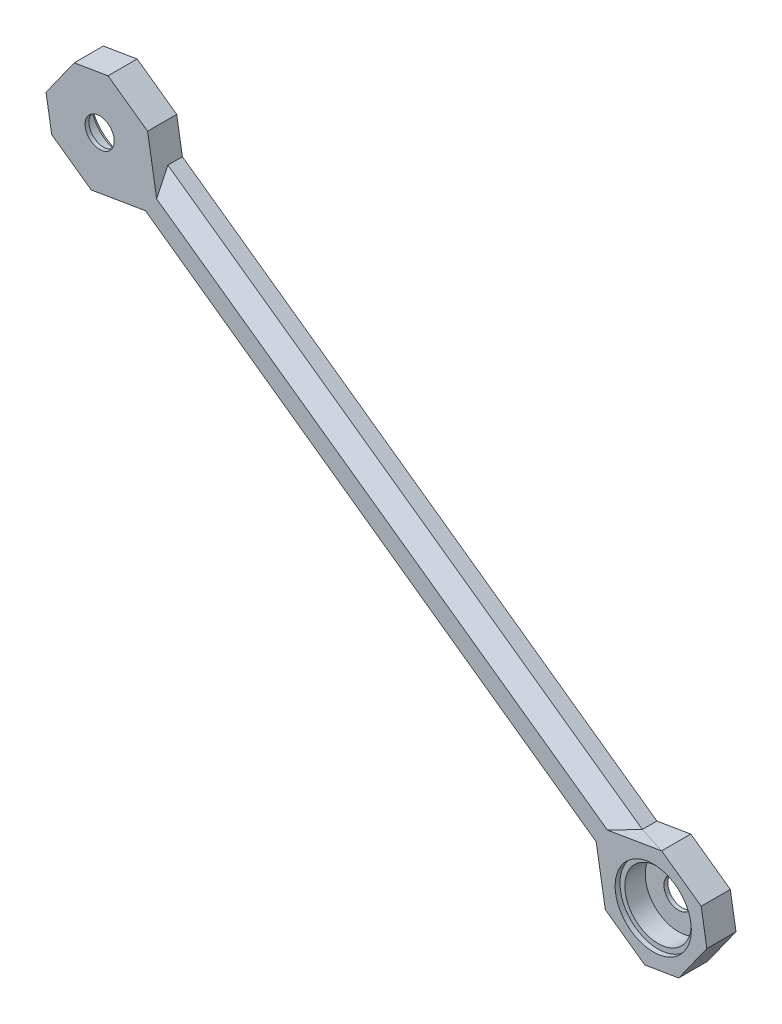
ISO-10303-21;
HEADER;
FILE_DESCRIPTION(('STEP AP214'),'2;1');
FILE_NAME('part.step','',(''),(''),'','','');
FILE_SCHEMA(('AUTOMOTIVE_DESIGN { 1 0 10303 214 1 1 1 1 }'));
ENDSEC;
DATA;
#1=APPLICATION_CONTEXT('core data for automotive mechanical design processes');
#2=APPLICATION_PROTOCOL_DEFINITION('international standard','automotive_design',2000,#1);
#3=PRODUCT_CONTEXT('',#1,'mechanical');
#4=PRODUCT('Part','Part','',(#3));
#5=PRODUCT_RELATED_PRODUCT_CATEGORY('part','',(#4));
#6=PRODUCT_DEFINITION_FORMATION('','',#4);
#7=PRODUCT_DEFINITION_CONTEXT('part definition',#1,'design');
#8=PRODUCT_DEFINITION('design','',#6,#7);
#9=PRODUCT_DEFINITION_SHAPE('','',#8);
#10=(LENGTH_UNIT() NAMED_UNIT(*) SI_UNIT(.MILLI.,.METRE.));
#11=(NAMED_UNIT(*) PLANE_ANGLE_UNIT() SI_UNIT($,.RADIAN.));
#12=(NAMED_UNIT(*) SI_UNIT($,.STERADIAN.) SOLID_ANGLE_UNIT());
#13=UNCERTAINTY_MEASURE_WITH_UNIT(LENGTH_MEASURE(1.E-05),#10,'distance_accuracy_value','');
#14=(GEOMETRIC_REPRESENTATION_CONTEXT(3) GLOBAL_UNCERTAINTY_ASSIGNED_CONTEXT((#13)) GLOBAL_UNIT_ASSIGNED_CONTEXT((#10,
#11,#12)) REPRESENTATION_CONTEXT('',''));
#15=CARTESIAN_POINT('',(0.,0.,0.));
#16=DIRECTION('',(0.,0.,1.));
#17=DIRECTION('',(1.,0.,0.));
#18=AXIS2_PLACEMENT_3D('',#15,#16,#17);
#19=CARTESIAN_POINT('',(24.6033055355398,-560.848772474689,0.800000052154064));
#20=DIRECTION('',(0.,0.,1.));
#21=DIRECTION('',(1.,0.,0.));
#22=AXIS2_PLACEMENT_3D('',#19,#20,#21);
#23=CYLINDRICAL_SURFACE('',#22,6.85);
#24=CARTESIAN_POINT('',(24.6033055355398,-560.848772474689,0.800000052154064));
#25=DIRECTION('',(0.,0.,1.));
#26=DIRECTION('',(1.,0.,0.));
#27=AXIS2_PLACEMENT_3D('',#24,#25,#26);
#28=CIRCLE('',#27,6.85);
#29=CARTESIAN_POINT('',(31.4533055355398,-560.848772474689,0.800000052154064));
#30=VERTEX_POINT('',#29);
#31=EDGE_CURVE('E1136',#30,#30,#28,.T.);
#32=ORIENTED_EDGE('',*,*,#31,.F.);
#33=EDGE_LOOP('',(#32));
#34=FACE_BOUND('',#33,.T.);
#35=CARTESIAN_POINT('',(24.6033055355398,-560.848772474689,5.00000005215406));
#36=DIRECTION('',(0.,0.,1.));
#37=DIRECTION('',(1.,0.,0.));
#38=AXIS2_PLACEMENT_3D('',#35,#36,#37);
#39=CIRCLE('',#38,6.85);
#40=CARTESIAN_POINT('',(31.4533055355398,-560.848772474689,5.00000005215406));
#41=VERTEX_POINT('',#40);
#42=EDGE_CURVE('E1134',#41,#41,#39,.F.);
#43=ORIENTED_EDGE('',*,*,#42,.F.);
#44=EDGE_LOOP('',(#43));
#45=FACE_BOUND('',#44,.T.);
#46=ADVANCED_FACE('F45',(#34,#45),#23,.F.);
#47=CARTESIAN_POINT('',(-89.4171845608694,-479.565260369701,5.2));
#48=DIRECTION('',(0.,0.,-1.));
#49=DIRECTION('',(-1.,0.,0.));
#50=AXIS2_PLACEMENT_3D('',#47,#48,#49);
#51=CYLINDRICAL_SURFACE('',#50,6.84999999999999);
#52=CARTESIAN_POINT('',(-89.4171845608694,-479.565260369701,5.2));
#53=DIRECTION('',(0.,0.,-1.));
#54=DIRECTION('',(-1.,0.,0.));
#55=AXIS2_PLACEMENT_3D('',#52,#53,#54);
#56=CIRCLE('',#55,6.84999999999999);
#57=CARTESIAN_POINT('',(-96.2671845608694,-479.565260369701,5.2));
#58=VERTEX_POINT('',#57);
#59=EDGE_CURVE('E1128',#58,#58,#56,.T.);
#60=ORIENTED_EDGE('',*,*,#59,.F.);
#61=EDGE_LOOP('',(#60));
#62=FACE_BOUND('',#61,.T.);
#63=CARTESIAN_POINT('',(-89.4171845608694,-479.565260369701,1.));
#64=DIRECTION('',(0.,0.,-1.));
#65=DIRECTION('',(-1.,0.,0.));
#66=AXIS2_PLACEMENT_3D('',#63,#64,#65);
#67=CIRCLE('',#66,6.84999999999999);
#68=CARTESIAN_POINT('',(-96.2671845608694,-479.565260369701,1.));
#69=VERTEX_POINT('',#68);
#70=EDGE_CURVE('E1124',#69,#69,#67,.F.);
#71=ORIENTED_EDGE('',*,*,#70,.F.);
#72=EDGE_LOOP('',(#71));
#73=FACE_BOUND('',#72,.T.);
#74=ADVANCED_FACE('F1545',(#62,#73),#51,.F.);
#75=CARTESIAN_POINT('',(289.510451461559,-206.267774443975,0.));
#76=DIRECTION('',(0.814431953554727,-0.580259074060054,0.));
#77=DIRECTION('',(0.580259074060054,0.814431953554727,0.));
#78=AXIS2_PLACEMENT_3D('',#75,#76,#77);
#79=PLANE('',#78);
#80=DIRECTION('',(0.580259074060054,0.814431953554727,0.));
#81=VECTOR('',#80,1.);
#82=CARTESIAN_POINT('',(29.8463255167007,-570.723533630371,0.));
#83=LINE('',#82,#81);
#84=CARTESIAN_POINT('',(29.8463255167007,-570.723533630371,0.));
#85=VERTEX_POINT('',#84);
#86=CARTESIAN_POINT('',(35.6489159166813,-562.579214572906,0.));
#87=VERTEX_POINT('',#86);
#88=EDGE_CURVE('E268',#85,#87,#83,.T.);
#89=ORIENTED_EDGE('',*,*,#88,.T.);
#90=DIRECTION('',(0.,0.,1.));
#91=VECTOR('',#90,1.);
#92=CARTESIAN_POINT('',(35.6489159166813,-562.579214572906,0.));
#93=LINE('',#92,#91);
#94=CARTESIAN_POINT('',(35.6489159166813,-562.579214572906,6.00000005215406));
#95=VERTEX_POINT('',#94);
#96=EDGE_CURVE('E1365',#87,#95,#93,.T.);
#97=ORIENTED_EDGE('',*,*,#96,.T.);
#98=DIRECTION('',(0.580259074060054,0.814431953554727,0.));
#99=VECTOR('',#98,1.);
#100=CARTESIAN_POINT('',(29.8463255167007,-570.723533630371,6.00000005215406));
#101=LINE('',#100,#99);
#102=CARTESIAN_POINT('',(29.8463255167007,-570.723533630371,6.00000005215406));
#103=VERTEX_POINT('',#102);
#104=EDGE_CURVE('E1369',#103,#95,#101,.T.);
#105=ORIENTED_EDGE('',*,*,#104,.F.);
#106=DIRECTION('',(0.,0.,1.));
#107=VECTOR('',#106,1.);
#108=CARTESIAN_POINT('',(29.8463255167007,-570.723533630371,0.));
#109=LINE('',#108,#107);
#110=EDGE_CURVE('E261',#85,#103,#109,.T.);
#111=ORIENTED_EDGE('',*,*,#110,.F.);
#112=EDGE_LOOP('',(#89,#97,#105,#111));
#113=FACE_BOUND('',#112,.T.);
#114=ADVANCED_FACE('F47',(#113),#79,.T.);
#115=CARTESIAN_POINT('',(-57.1976345466679,-9.60368548510984,0.));
#116=DIRECTION('',(0.986195404157694,0.165585702336409,0.));
#117=DIRECTION('',(-0.165585702336409,0.986195404157694,0.));
#118=AXIS2_PLACEMENT_3D('',#115,#116,#117);
#119=PLANE('',#118);
#120=DIRECTION('',(-0.16558570233641,0.986195404157694,0.));
#121=VECTOR('',#120,1.);
#122=CARTESIAN_POINT('',(35.6489159166813,-562.579214572906,6.00000005215406));
#123=LINE('',#122,#121);
#124=CARTESIAN_POINT('',(34.4780497252941,-555.60576915741,6.00000005215406));
#125=VERTEX_POINT('',#124);
#126=EDGE_CURVE('E205',#95,#125,#123,.T.);
#127=ORIENTED_EDGE('',*,*,#126,.F.);
#128=ORIENTED_EDGE('',*,*,#96,.F.);
#129=DIRECTION('',(-0.16558570233641,0.986195404157694,0.));
#130=VECTOR('',#129,1.);
#131=CARTESIAN_POINT('',(35.6489159166813,-562.579214572906,0.));
#132=LINE('',#131,#130);
#133=CARTESIAN_POINT('',(34.4780497252941,-555.60576915741,0.));
#134=VERTEX_POINT('',#133);
#135=EDGE_CURVE('E999',#87,#134,#132,.T.);
#136=ORIENTED_EDGE('',*,*,#135,.T.);
#137=DIRECTION('',(0.,0.,1.));
#138=VECTOR('',#137,1.);
#139=CARTESIAN_POINT('',(34.4780497252941,-555.60576915741,0.));
#140=LINE('',#139,#138);
#141=EDGE_CURVE('E260',#134,#125,#140,.T.);
#142=ORIENTED_EDGE('',*,*,#141,.T.);
#143=EDGE_LOOP('',(#127,#128,#136,#142));
#144=FACE_BOUND('',#143,.T.);
#145=ADVANCED_FACE('F997',(#144),#119,.T.);
#146=CARTESIAN_POINT('',(94.0178684560138,-559.948850045982,0.));
#147=DIRECTION('',(0.165586512036772,-0.986195268205793,0.));
#148=DIRECTION('',(0.986195268205793,0.165586512036772,0.));
#149=AXIS2_PLACEMENT_3D('',#146,#147,#148);
#150=PLANE('',#149);
#151=DIRECTION('',(0.986195268205793,0.165586512036772,0.));
#152=VECTOR('',#151,1.);
#153=CARTESIAN_POINT('',(22.8728707879782,-571.894407272339,0.));
#154=LINE('',#153,#152);
#155=CARTESIAN_POINT('',(22.8728707879782,-571.894407272339,0.));
#156=VERTEX_POINT('',#155);
#157=EDGE_CURVE('E241',#156,#85,#154,.T.);
#158=ORIENTED_EDGE('',*,*,#157,.T.);
#159=ORIENTED_EDGE('',*,*,#110,.T.);
#160=DIRECTION('',(0.986195268205793,0.165586512036772,0.));
#161=VECTOR('',#160,1.);
#162=CARTESIAN_POINT('',(22.8728707879782,-571.894407272339,6.00000005215406));
#163=LINE('',#162,#161);
#164=CARTESIAN_POINT('',(22.8728707879782,-571.894407272339,6.00000005215406));
#165=VERTEX_POINT('',#164);
#166=EDGE_CURVE('E254',#165,#103,#163,.T.);
#167=ORIENTED_EDGE('',*,*,#166,.F.);
#168=DIRECTION('',(0.,0.,1.));
#169=VECTOR('',#168,1.);
#170=CARTESIAN_POINT('',(22.8728707879782,-571.894407272339,0.));
#171=LINE('',#170,#169);
#172=EDGE_CURVE('E1419',#156,#165,#171,.T.);
#173=ORIENTED_EDGE('',*,*,#172,.F.);
#174=EDGE_LOOP('',(#158,#159,#167,#173));
#175=FACE_BOUND('',#174,.T.);
#176=ADVANCED_FACE('F1679',(#175),#150,.T.);
#177=CARTESIAN_POINT('',(-78.1179235721551,-13.1162656978368,0.));
#178=DIRECTION('',(-0.98619542566576,-0.165585574238612,0.));
#179=DIRECTION('',(0.165585574238612,-0.98619542566576,0.));
#180=AXIS2_PLACEMENT_3D('',#177,#178,#179);
#181=PLANE('',#180);
#182=DIRECTION('',(0.,0.,-1.));
#183=VECTOR('',#182,1.);
#184=CARTESIAN_POINT('',(14.7285498678684,-566.091775894165,6.00000005215406));
#185=LINE('',#184,#183);
#186=CARTESIAN_POINT('',(14.7285498678684,-566.091775894165,6.00000005215406));
#187=VERTEX_POINT('',#186);
#188=CARTESIAN_POINT('',(14.7285498678684,-566.091775894165,0.));
#189=VERTEX_POINT('',#188);
#190=EDGE_CURVE('E202',#187,#189,#185,.T.);
#191=ORIENTED_EDGE('',*,*,#190,.F.);
#192=DIRECTION('',(0.165585558226387,-0.986195428354267,0.));
#193=VECTOR('',#192,1.);
#194=CARTESIAN_POINT('',(12.8551656380296,-554.93426322937,6.00000005215406));
#195=LINE('',#194,#193);
#196=CARTESIAN_POINT('',(12.8551656380297,-554.93426322937,6.00000005215405));
#197=VERTEX_POINT('',#196);
#198=EDGE_CURVE('E184',#197,#187,#195,.T.);
#199=ORIENTED_EDGE('',*,*,#198,.F.);
#200=DIRECTION('',(-0.135199959433498,0.80522483621177,0.57735078948323));
#201=VECTOR('',#200,1.);
#202=CARTESIAN_POINT('',(13.5576846078038,-559.118330478668,3.00000002607703));
#203=LINE('',#202,#201);
#204=CARTESIAN_POINT('',(13.5576846078038,-559.118330478668,3.000000026077));
#205=VERTEX_POINT('',#204);
#206=EDGE_CURVE('E194',#205,#197,#203,.T.);
#207=ORIENTED_EDGE('',*,*,#206,.F.);
#208=DIRECTION('',(0.,0.,-1.));
#209=VECTOR('',#208,1.);
#210=CARTESIAN_POINT('',(13.5576846078038,-559.118330478668,3.00000002607703));
#211=LINE('',#210,#209);
#212=CARTESIAN_POINT('',(13.5576846078038,-559.118330478668,0.));
#213=VERTEX_POINT('',#212);
#214=EDGE_CURVE('E233',#205,#213,#211,.T.);
#215=ORIENTED_EDGE('',*,*,#214,.T.);
#216=DIRECTION('',(0.165585574238612,-0.98619542566576,0.));
#217=VECTOR('',#216,1.);
#218=CARTESIAN_POINT('',(13.5576846078038,-559.118330478668,0.));
#219=LINE('',#218,#217);
#220=EDGE_CURVE('E238',#213,#189,#219,.T.);
#221=ORIENTED_EDGE('',*,*,#220,.T.);
#222=EDGE_LOOP('',(#191,#199,#207,#215,#221));
#223=FACE_BOUND('',#222,.T.);
#224=ADVANCED_FACE('F198',(#223),#181,.T.);
#225=CARTESIAN_POINT('',(-262.565958897122,-368.526155219514,0.));
#226=DIRECTION('',(-0.580261704106491,-0.81443007971675,0.));
#227=DIRECTION('',(0.81443007971675,-0.580261704106491,0.));
#228=AXIS2_PLACEMENT_3D('',#225,#226,#227);
#229=PLANE('',#228);
#230=DIRECTION('',(0.81443007971675,-0.580261704106491,0.));
#231=VECTOR('',#230,1.);
#232=CARTESIAN_POINT('',(14.7285498678684,-566.091775894165,0.));
#233=LINE('',#232,#231);
#234=EDGE_CURVE('E581',#189,#156,#233,.T.);
#235=ORIENTED_EDGE('',*,*,#234,.T.);
#236=ORIENTED_EDGE('',*,*,#172,.T.);
#237=DIRECTION('',(-0.81443007971675,0.580261704106491,0.));
#238=VECTOR('',#237,1.);
#239=CARTESIAN_POINT('',(22.8728707879782,-571.894407272339,6.00000005215406));
#240=LINE('',#239,#238);
#241=EDGE_CURVE('E237',#165,#187,#240,.T.);
#242=ORIENTED_EDGE('',*,*,#241,.T.);
#243=ORIENTED_EDGE('',*,*,#190,.T.);
#244=EDGE_LOOP('',(#235,#236,#242,#243));
#245=FACE_BOUND('',#244,.T.);
#246=ADVANCED_FACE('F1661',(#245),#229,.T.);
#247=CARTESIAN_POINT('',(-250.960726123455,-352.23755546168,0.));
#248=DIRECTION('',(0.580261704106491,0.81443007971675,0.));
#249=DIRECTION('',(-0.81443007971675,0.580261704106491,0.));
#250=AXIS2_PLACEMENT_3D('',#247,#248,#249);
#251=PLANE('',#250);
#252=DIRECTION('',(-0.81443007971675,0.580261704106491,0.));
#253=VECTOR('',#252,1.);
#254=CARTESIAN_POINT('',(34.4780497252941,-555.60576915741,6.00000005215406));
#255=LINE('',#254,#253);
#256=CARTESIAN_POINT('',(26.3337288051844,-549.803137779236,6.00000005215406));
#257=VERTEX_POINT('',#256);
#258=EDGE_CURVE('E576',#125,#257,#255,.T.);
#259=ORIENTED_EDGE('',*,*,#258,.F.);
#260=ORIENTED_EDGE('',*,*,#141,.F.);
#261=DIRECTION('',(0.81443007971675,-0.580261704106491,0.));
#262=VECTOR('',#261,1.);
#263=CARTESIAN_POINT('',(26.3337288051844,-549.803137779236,0.));
#264=LINE('',#263,#262);
#265=CARTESIAN_POINT('',(26.3337288051844,-549.803137779236,0.));
#266=VERTEX_POINT('',#265);
#267=EDGE_CURVE('E212',#266,#134,#264,.T.);
#268=ORIENTED_EDGE('',*,*,#267,.F.);
#269=DIRECTION('',(0.,0.,-1.));
#270=VECTOR('',#269,1.);
#271=CARTESIAN_POINT('',(26.3337288051844,-549.803137779236,6.00000005215406));
#272=LINE('',#271,#270);
#273=EDGE_CURVE('E554',#257,#266,#272,.T.);
#274=ORIENTED_EDGE('',*,*,#273,.F.);
#275=EDGE_LOOP('',(#259,#260,#268,#274));
#276=FACE_BOUND('',#275,.T.);
#277=ADVANCED_FACE('F1001',(#276),#251,.T.);
#278=CARTESIAN_POINT('',(90.5041500427496,-539.028809444477,0.00267738503594632));
#279=DIRECTION('',(-0.16558446247261,0.986195612322252,-4.89848655337874E-06));
#280=DIRECTION('',(-0.986195612334084,-0.165584462474596,0.));
#281=AXIS2_PLACEMENT_3D('',#278,#279,#280);
#282=PLANE('',#281);
#283=DIRECTION('',(0.907866353071504,0.152434743551502,0.390566683063259));
#284=VECTOR('',#283,1.);
#285=CARTESIAN_POINT('',(19.3602740764618,-550.974011421204,3.00000002607703));
#286=LINE('',#285,#284);
#287=CARTESIAN_POINT('',(19.3602740764618,-550.974011421204,3.00000002607686));
#288=VERTEX_POINT('',#287);
#289=EDGE_CURVE('E553',#288,#257,#286,.T.);
#290=ORIENTED_EDGE('',*,*,#289,.F.);
#291=DIRECTION('',(-0.805225604579849,-0.135196323217841,0.577350569340149));
#292=VECTOR('',#291,1.);
#293=CARTESIAN_POINT('',(19.3602740764618,-550.974011421204,3.00000002607703));
#294=LINE('',#293,#292);
#295=CARTESIAN_POINT('',(15.1762012392282,-551.676511764527,6.00000005215392));
#296=VERTEX_POINT('',#295);
#297=EDGE_CURVE('E159',#288,#296,#294,.T.);
#298=ORIENTED_EDGE('',*,*,#297,.T.);
#299=DIRECTION('',(-0.986195612334084,-0.165584462474596,0.));
#300=VECTOR('',#299,1.);
#301=CARTESIAN_POINT('',(26.3337288051844,-549.803137779236,6.00000005215406));
#302=LINE('',#301,#300);
#303=EDGE_CURVE('E218',#257,#296,#302,.T.);
#304=ORIENTED_EDGE('',*,*,#303,.F.);
#305=EDGE_LOOP('',(#290,#298,#304));
#306=FACE_BOUND('',#305,.T.);
#307=ADVANCED_FACE('F1004',(#306),#282,.T.);
#308=CARTESIAN_POINT('',(77.6247110762013,-462.320850205347,-0.00234456824753168));
#309=DIRECTION('',(0.165584462472525,-0.98619561232175,-5.00129491775601E-06));
#310=DIRECTION('',(0.986195612334084,0.165584462474596,0.));
#311=AXIS2_PLACEMENT_3D('',#308,#309,#310);
#312=PLANE('',#311);
#313=DIRECTION('',(-0.907866310445912,-0.152434777110581,0.390566769047974));
#314=VECTOR('',#313,1.);
#315=CARTESIAN_POINT('',(-84.1741636395454,-489.487260580063,3.00000002607703));
#316=LINE('',#315,#314);
#317=CARTESIAN_POINT('',(-84.1741667524352,-489.487264949212,3.00000539072692));
#318=VERTEX_POINT('',#317);
#319=CARTESIAN_POINT('',(-91.1476165056229,-490.658134222031,6.00000005215406));
#320=VERTEX_POINT('',#319);
#321=EDGE_CURVE('E1209',#318,#320,#316,.T.);
#322=ORIENTED_EDGE('',*,*,#321,.F.);
#323=DIRECTION('',(-0.805225730620787,-0.135196284193927,-0.577350402690061));
#324=VECTOR('',#323,1.);
#325=CARTESIAN_POINT('',(-79.9900889396667,-488.78476023674,6.00000005215406));
#326=LINE('',#325,#324);
#327=CARTESIAN_POINT('',(-79.9900889396667,-488.78476023674,6.00000005215401));
#328=VERTEX_POINT('',#327);
#329=EDGE_CURVE('E1213',#328,#318,#326,.T.);
#330=ORIENTED_EDGE('',*,*,#329,.F.);
#331=DIRECTION('',(-0.986195612334084,-0.165584462474596,0.));
#332=VECTOR('',#331,1.);
#333=CARTESIAN_POINT('',(-79.9900889396667,-488.78476023674,6.00000005215406));
#334=LINE('',#333,#332);
#335=EDGE_CURVE('E188',#328,#320,#334,.T.);
#336=ORIENTED_EDGE('',*,*,#335,.T.);
#337=EDGE_LOOP('',(#322,#330,#336));
#338=FACE_BOUND('',#337,.T.);
#339=ADVANCED_FACE('F1636',(#338),#312,.T.);
#340=CARTESIAN_POINT('',(-259.664083093238,-364.45584996912,0.));
#341=DIRECTION('',(0.580258914671925,0.814432067114109,0.));
#342=DIRECTION('',(-0.814432067114109,0.580258914671925,0.));
#343=AXIS2_PLACEMENT_3D('',#340,#341,#342);
#344=PLANE('',#343);
#345=DIRECTION('',(0.,0.,1.));
#346=VECTOR('',#345,1.);
#347=CARTESIAN_POINT('',(-84.1741636395454,-489.487260580063,0.));
#348=LINE('',#347,#346);
#349=CARTESIAN_POINT('',(-84.1741636395454,-489.487260580063,0.));
#350=VERTEX_POINT('',#349);
#351=EDGE_CURVE('E559',#350,#318,#348,.T.);
#352=ORIENTED_EDGE('',*,*,#351,.F.);
#353=DIRECTION('',(0.814432067114109,-0.580258914671925,0.));
#354=VECTOR('',#353,1.);
#355=CARTESIAN_POINT('',(-84.1741636395454,-489.487260580063,0.));
#356=LINE('',#355,#354);
#357=EDGE_CURVE('E204',#350,#213,#356,.T.);
#358=ORIENTED_EDGE('',*,*,#357,.T.);
#359=ORIENTED_EDGE('',*,*,#214,.F.);
#360=DIRECTION('',(-0.814432067114109,0.580258914671925,0.));
#361=VECTOR('',#360,1.);
#362=CARTESIAN_POINT('',(13.5576846078038,-559.118330478668,3.00000002607703));
#363=LINE('',#362,#361);
#364=EDGE_CURVE('E210',#205,#318,#363,.T.);
#365=ORIENTED_EDGE('',*,*,#364,.T.);
#366=EDGE_LOOP('',(#352,#358,#359,#365));
#367=FACE_BOUND('',#366,.T.);
#368=ADVANCED_FACE('F1628',(#367),#344,.F.);
#369=CARTESIAN_POINT('',(77.6256369026728,-462.320356985992,0.));
#370=DIRECTION('',(-0.16558655505307,0.986195260983167,0.));
#371=DIRECTION('',(-0.986195260983167,-0.16558655505307,0.));
#372=AXIS2_PLACEMENT_3D('',#369,#370,#371);
#373=PLANE('',#372);
#374=ORIENTED_EDGE('',*,*,#351,.T.);
#375=ORIENTED_EDGE('',*,*,#321,.T.);
#376=DIRECTION('',(0.,0.,1.));
#377=VECTOR('',#376,1.);
#378=CARTESIAN_POINT('',(-91.1476165056229,-490.658134222031,0.));
#379=LINE('',#378,#377);
#380=CARTESIAN_POINT('',(-91.1476165056229,-490.658134222031,0.));
#381=VERTEX_POINT('',#380);
#382=EDGE_CURVE('E545',#381,#320,#379,.T.);
#383=ORIENTED_EDGE('',*,*,#382,.F.);
#384=DIRECTION('',(0.986195260983167,0.16558655505307,0.));
#385=VECTOR('',#384,1.);
#386=CARTESIAN_POINT('',(-91.1476165056229,-490.658134222031,0.));
#387=LINE('',#386,#385);
#388=EDGE_CURVE('E564',#381,#350,#387,.T.);
#389=ORIENTED_EDGE('',*,*,#388,.T.);
#390=EDGE_LOOP('',(#374,#375,#383,#389));
#391=FACE_BOUND('',#390,.T.);
#392=ADVANCED_FACE('F1618',(#391),#373,.F.);
#393=CARTESIAN_POINT('',(90.5052430231328,-539.02845901729,0.));
#394=DIRECTION('',(0.165586512036772,-0.986195268205793,0.));
#395=DIRECTION('',(0.986195268205793,0.165586512036772,0.));
#396=AXIS2_PLACEMENT_3D('',#393,#394,#395);
#397=PLANE('',#396);
#398=DIRECTION('',(0.,0.,1.));
#399=VECTOR('',#398,1.);
#400=CARTESIAN_POINT('',(19.3602740764618,-550.974011421204,0.));
#401=LINE('',#400,#399);
#402=CARTESIAN_POINT('',(19.3602740764618,-550.974011421204,0.));
#403=VERTEX_POINT('',#402);
#404=EDGE_CURVE('E541',#403,#288,#401,.T.);
#405=ORIENTED_EDGE('',*,*,#404,.T.);
#406=ORIENTED_EDGE('',*,*,#289,.T.);
#407=ORIENTED_EDGE('',*,*,#273,.T.);
#408=DIRECTION('',(-0.986195268205793,-0.165586512036772,0.));
#409=VECTOR('',#408,1.);
#410=CARTESIAN_POINT('',(26.3337288051844,-549.803137779236,0.));
#411=LINE('',#410,#409);
#412=EDGE_CURVE('E546',#266,#403,#411,.T.);
#413=ORIENTED_EDGE('',*,*,#412,.T.);
#414=EDGE_LOOP('',(#405,#406,#407,#413));
#415=FACE_BOUND('',#414,.T.);
#416=ADVANCED_FACE('F1006',(#415),#397,.F.);
#417=CARTESIAN_POINT('',(-253.861465544377,-356.31162495909,0.));
#418=DIRECTION('',(-0.580258768278229,-0.814432171415295,0.));
#419=DIRECTION('',(0.814432171415295,-0.580258768278229,0.));
#420=AXIS2_PLACEMENT_3D('',#417,#418,#419);
#421=PLANE('',#420);
#422=DIRECTION('',(0.,0.,-1.));
#423=VECTOR('',#422,1.);
#424=CARTESIAN_POINT('',(-78.3715695142746,-481.342971324921,3.00000002607703));
#425=LINE('',#424,#423);
#426=CARTESIAN_POINT('',(-78.3715665341136,-481.342967142065,3.00000516196629));
#427=VERTEX_POINT('',#426);
#428=CARTESIAN_POINT('',(-78.3715695142746,-481.342971324921,0.));
#429=VERTEX_POINT('',#428);
#430=EDGE_CURVE('E1235',#427,#429,#425,.T.);
#431=ORIENTED_EDGE('',*,*,#430,.F.);
#432=DIRECTION('',(0.814432171415295,-0.580258768278229,0.));
#433=VECTOR('',#432,1.);
#434=CARTESIAN_POINT('',(-78.3715695142746,-481.342971324921,3.00000002607703));
#435=LINE('',#434,#433);
#436=EDGE_CURVE('E549',#427,#288,#435,.T.);
#437=ORIENTED_EDGE('',*,*,#436,.T.);
#438=ORIENTED_EDGE('',*,*,#404,.F.);
#439=DIRECTION('',(-0.814432171415295,0.580258768278229,0.));
#440=VECTOR('',#439,1.);
#441=CARTESIAN_POINT('',(19.3602740764618,-550.974011421204,0.));
#442=LINE('',#441,#440);
#443=EDGE_CURVE('E1014',#403,#429,#442,.T.);
#444=ORIENTED_EDGE('',*,*,#443,.T.);
#445=EDGE_LOOP('',(#431,#437,#438,#444));
#446=FACE_BOUND('',#445,.T.);
#447=ADVANCED_FACE('F1013',(#446),#421,.F.);
#448=CARTESIAN_POINT('',(74.113015372945,-441.39999479152,0.));
#449=DIRECTION('',(-0.16558655505307,0.986195260983167,0.));
#450=DIRECTION('',(-0.986195260983167,-0.16558655505307,0.));
#451=AXIS2_PLACEMENT_3D('',#448,#449,#450);
#452=PLANE('',#451);
#453=DIRECTION('',(-0.986195260983167,-0.16558655505307,0.));
#454=VECTOR('',#453,1.);
#455=CARTESIAN_POINT('',(-87.686762213707,-468.56689453125,0.));
#456=LINE('',#455,#454);
#457=CARTESIAN_POINT('',(-87.686762213707,-468.56689453125,0.));
#458=VERTEX_POINT('',#457);
#459=CARTESIAN_POINT('',(-94.6602150797844,-469.737768173218,0.));
#460=VERTEX_POINT('',#459);
#461=EDGE_CURVE('E527',#458,#460,#456,.T.);
#462=ORIENTED_EDGE('',*,*,#461,.T.);
#463=DIRECTION('',(0.,0.,1.));
#464=VECTOR('',#463,1.);
#465=CARTESIAN_POINT('',(-94.6602150797844,-469.737768173218,0.));
#466=LINE('',#465,#464);
#467=CARTESIAN_POINT('',(-94.6602150797844,-469.737768173218,6.00000005215406));
#468=VERTEX_POINT('',#467);
#469=EDGE_CURVE('E1021',#460,#468,#466,.T.);
#470=ORIENTED_EDGE('',*,*,#469,.T.);
#471=DIRECTION('',(0.986195260983167,0.16558655505307,0.));
#472=VECTOR('',#471,1.);
#473=CARTESIAN_POINT('',(-94.6602150797844,-469.737768173218,6.00000005215406));
#474=LINE('',#473,#472);
#475=CARTESIAN_POINT('',(-87.686762213707,-468.56689453125,6.00000005215406));
#476=VERTEX_POINT('',#475);
#477=EDGE_CURVE('E1030',#468,#476,#474,.T.);
#478=ORIENTED_EDGE('',*,*,#477,.T.);
#479=DIRECTION('',(0.,0.,1.));
#480=VECTOR('',#479,1.);
#481=CARTESIAN_POINT('',(-87.686762213707,-468.56689453125,0.));
#482=LINE('',#481,#480);
#483=EDGE_CURVE('E1113',#458,#476,#482,.T.);
#484=ORIENTED_EDGE('',*,*,#483,.F.);
#485=EDGE_LOOP('',(#462,#470,#478,#484));
#486=FACE_BOUND('',#485,.T.);
#487=ADVANCED_FACE('F1594',(#486),#452,.T.);
#488=CARTESIAN_POINT('',(-154.825668387373,-25.9956671546598,0.));
#489=DIRECTION('',(0.986195519717988,0.165585014080885,0.));
#490=DIRECTION('',(-0.165585014080885,0.986195519717988,0.));
#491=AXIS2_PLACEMENT_3D('',#488,#489,#490);
#492=PLANE('',#491);
#493=DIRECTION('',(0.,0.,-1.));
#494=VECTOR('',#493,1.);
#495=CARTESIAN_POINT('',(-79.5424357056618,-474.369496107101,6.00000005215406));
#496=LINE('',#495,#494);
#497=CARTESIAN_POINT('',(-79.5424357056618,-474.369496107101,6.00000005215406));
#498=VERTEX_POINT('',#497);
#499=CARTESIAN_POINT('',(-79.5424357056618,-474.369496107101,0.));
#500=VERTEX_POINT('',#499);
#501=EDGE_CURVE('E151',#498,#500,#496,.T.);
#502=ORIENTED_EDGE('',*,*,#501,.F.);
#503=DIRECTION('',(0.165585318042993,-0.986195468681843,0.));
#504=VECTOR('',#503,1.);
#505=CARTESIAN_POINT('',(-79.5424357056618,-474.369496107101,6.00000005215406));
#506=LINE('',#505,#504);
#507=CARTESIAN_POINT('',(-77.6690481823151,-485.527012877944,5.99999986393853));
#508=VERTEX_POINT('',#507);
#509=EDGE_CURVE('E526',#498,#508,#506,.T.);
#510=ORIENTED_EDGE('',*,*,#509,.T.);
#511=DIRECTION('',(-0.135199880003315,0.805222897584278,-0.57735351185653));
#512=VECTOR('',#511,1.);
#513=CARTESIAN_POINT('',(-77.6690542697906,-485.527008771896,6.00000005215406));
#514=LINE('',#513,#512);
#515=EDGE_CURVE('E521',#508,#427,#514,.T.);
#516=ORIENTED_EDGE('',*,*,#515,.T.);
#517=ORIENTED_EDGE('',*,*,#430,.T.);
#518=DIRECTION('',(-0.165585014080885,0.986195519717988,0.));
#519=VECTOR('',#518,1.);
#520=CARTESIAN_POINT('',(-78.3715695142746,-481.342971324921,0.));
#521=LINE('',#520,#519);
#522=EDGE_CURVE('E1019',#429,#500,#521,.T.);
#523=ORIENTED_EDGE('',*,*,#522,.T.);
#524=EDGE_LOOP('',(#502,#510,#516,#517,#523));
#525=FACE_BOUND('',#524,.T.);
#526=ADVANCED_FACE('F1230',(#525),#492,.T.);
#527=CARTESIAN_POINT('',(-250.960358086278,-352.239089676026,0.));
#528=DIRECTION('',(0.580259463253697,0.814431676265438,0.));
#529=DIRECTION('',(-0.814431676265438,0.580259463253697,0.));
#530=AXIS2_PLACEMENT_3D('',#527,#528,#529);
#531=PLANE('',#530);
#532=DIRECTION('',(-0.814431676265438,0.580259463253697,0.));
#533=VECTOR('',#532,1.);
#534=CARTESIAN_POINT('',(-79.5424357056618,-474.369496107101,0.));
#535=LINE('',#534,#533);
#536=EDGE_CURVE('E1107',#500,#458,#535,.T.);
#537=ORIENTED_EDGE('',*,*,#536,.T.);
#538=ORIENTED_EDGE('',*,*,#483,.T.);
#539=DIRECTION('',(0.814431676265438,-0.580259463253697,0.));
#540=VECTOR('',#539,1.);
#541=CARTESIAN_POINT('',(-87.686762213707,-468.56689453125,6.00000005215406));
#542=LINE('',#541,#540);
#543=EDGE_CURVE('E1239',#476,#498,#542,.T.);
#544=ORIENTED_EDGE('',*,*,#543,.T.);
#545=ORIENTED_EDGE('',*,*,#501,.T.);
#546=EDGE_LOOP('',(#537,#538,#544,#545));
#547=FACE_BOUND('',#546,.T.);
#548=ADVANCED_FACE('F1577',(#547),#531,.T.);
#549=CARTESIAN_POINT('',(-262.565653194173,-368.527534622462,0.));
#550=DIRECTION('',(-0.58025981535423,-0.814431425403683,0.));
#551=DIRECTION('',(0.814431425403683,-0.58025981535423,0.));
#552=AXIS2_PLACEMENT_3D('',#549,#550,#551);
#553=PLANE('',#552);
#554=DIRECTION('',(0.814431425403683,-0.58025981535423,0.));
#555=VECTOR('',#554,1.);
#556=CARTESIAN_POINT('',(-99.2919355630875,-484.855532646179,0.));
#557=LINE('',#556,#555);
#558=CARTESIAN_POINT('',(-99.2919355630875,-484.855532646179,0.));
#559=VERTEX_POINT('',#558);
#560=EDGE_CURVE('E1100',#559,#381,#557,.T.);
#561=ORIENTED_EDGE('',*,*,#560,.T.);
#562=ORIENTED_EDGE('',*,*,#382,.T.);
#563=DIRECTION('',(0.814431425403683,-0.58025981535423,0.));
#564=VECTOR('',#563,1.);
#565=CARTESIAN_POINT('',(-99.2919355630875,-484.855532646179,6.00000005215406));
#566=LINE('',#565,#564);
#567=CARTESIAN_POINT('',(-99.2919355630875,-484.855532646179,6.00000005215406));
#568=VERTEX_POINT('',#567);
#569=EDGE_CURVE('E1051',#568,#320,#566,.T.);
#570=ORIENTED_EDGE('',*,*,#569,.F.);
#571=DIRECTION('',(0.,0.,1.));
#572=VECTOR('',#571,1.);
#573=CARTESIAN_POINT('',(-99.2919355630875,-484.855532646179,0.));
#574=LINE('',#573,#572);
#575=EDGE_CURVE('E1106',#559,#568,#574,.T.);
#576=ORIENTED_EDGE('',*,*,#575,.F.);
#577=EDGE_LOOP('',(#561,#562,#570,#576));
#578=FACE_BOUND('',#577,.T.);
#579=ADVANCED_FACE('F1190',(#578),#553,.T.);
#580=CARTESIAN_POINT('',(-175.746327175569,-29.5084309820589,0.));
#581=DIRECTION('',(-0.986195404157694,-0.165585702336409,0.));
#582=DIRECTION('',(0.165585702336409,-0.986195404157694,0.));
#583=AXIS2_PLACEMENT_3D('',#580,#581,#582);
#584=PLANE('',#583);
#585=DIRECTION('',(0.16558570233641,-0.986195404157694,0.));
#586=VECTOR('',#585,1.);
#587=CARTESIAN_POINT('',(-100.462801754475,-477.882087230682,0.));
#588=LINE('',#587,#586);
#589=CARTESIAN_POINT('',(-100.462801754475,-477.882087230682,0.));
#590=VERTEX_POINT('',#589);
#591=EDGE_CURVE('E1168',#590,#559,#588,.T.);
#592=ORIENTED_EDGE('',*,*,#591,.T.);
#593=ORIENTED_EDGE('',*,*,#575,.T.);
#594=DIRECTION('',(0.16558570233641,-0.986195404157694,0.));
#595=VECTOR('',#594,1.);
#596=CARTESIAN_POINT('',(-100.462801754475,-477.882087230682,6.00000005215406));
#597=LINE('',#596,#595);
#598=CARTESIAN_POINT('',(-100.462801754475,-477.882087230682,6.00000005215406));
#599=VERTEX_POINT('',#598);
#600=EDGE_CURVE('E12',#599,#568,#597,.T.);
#601=ORIENTED_EDGE('',*,*,#600,.F.);
#602=DIRECTION('',(0.,0.,1.));
#603=VECTOR('',#602,1.);
#604=CARTESIAN_POINT('',(-100.462801754475,-477.882087230682,0.));
#605=LINE('',#604,#603);
#606=EDGE_CURVE('E1164',#590,#599,#605,.T.);
#607=ORIENTED_EDGE('',*,*,#606,.F.);
#608=EDGE_LOOP('',(#592,#593,#601,#607));
#609=FACE_BOUND('',#608,.T.);
#610=ADVANCED_FACE('F1178',(#609),#584,.T.);
#611=CARTESIAN_POINT('',(159.201255553948,-113.426190397663,0.));
#612=DIRECTION('',(-0.814432129605077,0.580258826961675,0.));
#613=DIRECTION('',(-0.580258826961675,-0.814432129605077,0.));
#614=AXIS2_PLACEMENT_3D('',#611,#612,#613);
#615=PLANE('',#614);
#616=DIRECTION('',(-0.580258826961675,-0.814432129605077,0.));
#617=VECTOR('',#616,1.);
#618=CARTESIAN_POINT('',(-94.6602150797844,-469.737768173218,6.00000005215406));
#619=LINE('',#618,#617);
#620=EDGE_CURVE('E56',#468,#599,#619,.T.);
#621=ORIENTED_EDGE('',*,*,#620,.F.);
#622=ORIENTED_EDGE('',*,*,#469,.F.);
#623=DIRECTION('',(-0.580258826961675,-0.814432129605077,0.));
#624=VECTOR('',#623,1.);
#625=CARTESIAN_POINT('',(-94.6602150797844,-469.737768173218,0.));
#626=LINE('',#625,#624);
#627=EDGE_CURVE('E1046',#460,#590,#626,.T.);
#628=ORIENTED_EDGE('',*,*,#627,.T.);
#629=ORIENTED_EDGE('',*,*,#606,.T.);
#630=EDGE_LOOP('',(#621,#622,#628,#629));
#631=FACE_BOUND('',#630,.T.);
#632=ADVANCED_FACE('F1185',(#631),#615,.T.);
#633=CARTESIAN_POINT('',(0.,0.,0.));
#634=DIRECTION('',(0.,0.,1.));
#635=DIRECTION('',(1.,0.,0.));
#636=AXIS2_PLACEMENT_3D('',#633,#634,#635);
#637=PLANE('',#636);
#638=CARTESIAN_POINT('',(24.6033055355398,-560.848772474689,0.));
#639=DIRECTION('',(0.,0.,-1.));
#640=DIRECTION('',(-1.,0.,0.));
#641=AXIS2_PLACEMENT_3D('',#638,#639,#640);
#642=CIRCLE('',#641,3.00000000000001);
#643=CARTESIAN_POINT('',(21.6033055355397,-560.848772474689,0.));
#644=VERTEX_POINT('',#643);
#645=EDGE_CURVE('E1150',#644,#644,#642,.T.);
#646=ORIENTED_EDGE('',*,*,#645,.F.);
#647=EDGE_LOOP('',(#646));
#648=FACE_BOUND('',#647,.T.);
#649=CARTESIAN_POINT('',(-89.4171845608694,-479.565260369701,0.));
#650=DIRECTION('',(0.,0.,-1.));
#651=DIRECTION('',(-1.,0.,0.));
#652=AXIS2_PLACEMENT_3D('',#649,#650,#651);
#653=CIRCLE('',#652,7.84999999999999);
#654=CARTESIAN_POINT('',(-97.2671845608694,-479.565260369701,0.));
#655=VERTEX_POINT('',#654);
#656=EDGE_CURVE('E1132',#655,#655,#653,.T.);
#657=ORIENTED_EDGE('',*,*,#656,.F.);
#658=EDGE_LOOP('',(#657));
#659=FACE_BOUND('',#658,.T.);
#660=ORIENTED_EDGE('',*,*,#522,.F.);
#661=ORIENTED_EDGE('',*,*,#443,.F.);
#662=ORIENTED_EDGE('',*,*,#412,.F.);
#663=ORIENTED_EDGE('',*,*,#267,.T.);
#664=ORIENTED_EDGE('',*,*,#135,.F.);
#665=ORIENTED_EDGE('',*,*,#88,.F.);
#666=ORIENTED_EDGE('',*,*,#157,.F.);
#667=ORIENTED_EDGE('',*,*,#234,.F.);
#668=ORIENTED_EDGE('',*,*,#220,.F.);
#669=ORIENTED_EDGE('',*,*,#357,.F.);
#670=ORIENTED_EDGE('',*,*,#388,.F.);
#671=ORIENTED_EDGE('',*,*,#560,.F.);
#672=ORIENTED_EDGE('',*,*,#591,.F.);
#673=ORIENTED_EDGE('',*,*,#627,.F.);
#674=ORIENTED_EDGE('',*,*,#461,.F.);
#675=ORIENTED_EDGE('',*,*,#536,.F.);
#676=EDGE_LOOP('',(#660,#661,#662,#663,#664,#665,#666,#667,#668,#669,#670,#671,#672,#673,#674,#675));
#677=FACE_BOUND('',#676,.T.);
#678=ADVANCED_FACE('F1017',(#648,#659,#677),#637,.F.);
#679=CARTESIAN_POINT('',(0.,0.,6.00000005215406));
#680=DIRECTION('',(0.,0.,-1.));
#681=DIRECTION('',(-1.,0.,0.));
#682=AXIS2_PLACEMENT_3D('',#679,#680,#681);
#683=PLANE('',#682);
#684=CARTESIAN_POINT('',(24.6033055355398,-560.848772474689,6.00000005215406));
#685=DIRECTION('',(0.,0.,1.));
#686=DIRECTION('',(1.,0.,0.));
#687=AXIS2_PLACEMENT_3D('',#684,#685,#686);
#688=CIRCLE('',#687,7.85);
#689=CARTESIAN_POINT('',(32.4533055355398,-560.848772474689,6.00000005215406));
#690=VERTEX_POINT('',#689);
#691=EDGE_CURVE('E1143',#690,#690,#688,.T.);
#692=ORIENTED_EDGE('',*,*,#691,.F.);
#693=EDGE_LOOP('',(#692));
#694=FACE_BOUND('',#693,.T.);
#695=CARTESIAN_POINT('',(-89.4171845608694,-479.565260369701,6.00000005215406));
#696=DIRECTION('',(0.,0.,1.));
#697=DIRECTION('',(1.,0.,0.));
#698=AXIS2_PLACEMENT_3D('',#695,#696,#697);
#699=CIRCLE('',#698,3.00000000000001);
#700=CARTESIAN_POINT('',(-86.4171845608694,-479.565260369701,6.00000005215406));
#701=VERTEX_POINT('',#700);
#702=EDGE_CURVE('E1133',#701,#701,#699,.T.);
#703=ORIENTED_EDGE('',*,*,#702,.F.);
#704=EDGE_LOOP('',(#703));
#705=FACE_BOUND('',#704,.T.);
#706=ORIENTED_EDGE('',*,*,#198,.T.);
#707=ORIENTED_EDGE('',*,*,#241,.F.);
#708=ORIENTED_EDGE('',*,*,#166,.T.);
#709=ORIENTED_EDGE('',*,*,#104,.T.);
#710=ORIENTED_EDGE('',*,*,#126,.T.);
#711=ORIENTED_EDGE('',*,*,#258,.T.);
#712=ORIENTED_EDGE('',*,*,#303,.T.);
#713=DIRECTION('',(-0.81443212174621,0.580258837992121,0.));
#714=VECTOR('',#713,1.);
#715=CARTESIAN_POINT('',(15.1762012392282,-551.676511764526,6.00000005215406));
#716=LINE('',#715,#714);
#717=EDGE_CURVE('E164',#296,#508,#716,.T.);
#718=ORIENTED_EDGE('',*,*,#717,.T.);
#719=ORIENTED_EDGE('',*,*,#509,.F.);
#720=ORIENTED_EDGE('',*,*,#543,.F.);
#721=ORIENTED_EDGE('',*,*,#477,.F.);
#722=ORIENTED_EDGE('',*,*,#620,.T.);
#723=ORIENTED_EDGE('',*,*,#600,.T.);
#724=ORIENTED_EDGE('',*,*,#569,.T.);
#725=ORIENTED_EDGE('',*,*,#335,.F.);
#726=DIRECTION('',(0.814432118995538,-0.580258841852874,0.));
#727=VECTOR('',#726,1.);
#728=CARTESIAN_POINT('',(-79.9900889396667,-488.78476023674,6.00000005215406));
#729=LINE('',#728,#727);
#730=EDGE_CURVE('E180',#328,#197,#729,.T.);
#731=ORIENTED_EDGE('',*,*,#730,.T.);
#732=EDGE_LOOP('',(#706,#707,#708,#709,#710,#711,#712,#718,#719,#720,#721,#722,#723,#724,#725,#731));
#733=FACE_BOUND('',#732,.T.);
#734=ADVANCED_FACE('F182',(#694,#705,#733),#683,.F.);
#735=CARTESIAN_POINT('',(-126.061025782532,-176.935088232061,-217.248489458046));
#736=DIRECTION('',(0.410306049118392,0.575892005893627,0.707104902828902));
#737=DIRECTION('',(0.,-0.775378630721746,0.6314966183758));
#738=AXIS2_PLACEMENT_3D('',#735,#736,#737);
#739=PLANE('',#738);
#740=ORIENTED_EDGE('',*,*,#436,.F.);
#741=ORIENTED_EDGE('',*,*,#515,.F.);
#742=ORIENTED_EDGE('',*,*,#717,.F.);
#743=ORIENTED_EDGE('',*,*,#297,.F.);
#744=EDGE_LOOP('',(#740,#741,#742,#743));
#745=FACE_BOUND('',#744,.T.);
#746=ADVANCED_FACE('F1542',(#745),#739,.T.);
#747=CARTESIAN_POINT('',(-130.702600269057,-183.449846891505,225.248478101957));
#748=DIRECTION('',(0.410305243249623,0.575890869026152,-0.707106296347425));
#749=DIRECTION('',(0.,0.775379850509296,0.631495120665379));
#750=AXIS2_PLACEMENT_3D('',#747,#748,#749);
#751=PLANE('',#750);
#752=ORIENTED_EDGE('',*,*,#329,.T.);
#753=ORIENTED_EDGE('',*,*,#364,.F.);
#754=ORIENTED_EDGE('',*,*,#206,.T.);
#755=ORIENTED_EDGE('',*,*,#730,.F.);
#756=EDGE_LOOP('',(#752,#753,#754,#755));
#757=FACE_BOUND('',#756,.T.);
#758=ADVANCED_FACE('F208',(#757),#751,.F.);
#759=CARTESIAN_POINT('',(-89.4171845608694,-479.565260369701,5.2));
#760=DIRECTION('',(0.,0.,-1.));
#761=DIRECTION('',(-1.,0.,0.));
#762=AXIS2_PLACEMENT_3D('',#759,#760,#761);
#763=PLANE('',#762);
#764=CARTESIAN_POINT('',(-89.4171845608694,-479.565260369701,5.2));
#765=DIRECTION('',(0.,0.,-1.));
#766=DIRECTION('',(-1.,0.,0.));
#767=AXIS2_PLACEMENT_3D('',#764,#765,#766);
#768=CIRCLE('',#767,3.00000000000001);
#769=CARTESIAN_POINT('',(-92.4171845608694,-479.565260369701,5.2));
#770=VERTEX_POINT('',#769);
#771=EDGE_CURVE('E1130',#770,#770,#768,.T.);
#772=ORIENTED_EDGE('',*,*,#771,.F.);
#773=EDGE_LOOP('',(#772));
#774=FACE_BOUND('',#773,.T.);
#775=ORIENTED_EDGE('',*,*,#59,.T.);
#776=EDGE_LOOP('',(#775));
#777=FACE_BOUND('',#776,.T.);
#778=ADVANCED_FACE('F2253',(#774,#777),#763,.T.);
#779=CARTESIAN_POINT('',(-89.4171845608694,-479.565260369701,1.));
#780=DIRECTION('',(0.,0.,-1.));
#781=DIRECTION('',(-1.,0.,0.));
#782=AXIS2_PLACEMENT_3D('',#779,#780,#781);
#783=PLANE('',#782);
#784=CARTESIAN_POINT('',(-89.4171845608694,-479.565260369701,1.));
#785=DIRECTION('',(0.,0.,-1.));
#786=DIRECTION('',(-1.,0.,0.));
#787=AXIS2_PLACEMENT_3D('',#784,#785,#786);
#788=CIRCLE('',#787,7.84999999999999);
#789=CARTESIAN_POINT('',(-97.2671845608694,-479.565260369701,1.));
#790=VERTEX_POINT('',#789);
#791=EDGE_CURVE('E1129',#790,#790,#788,.T.);
#792=ORIENTED_EDGE('',*,*,#791,.T.);
#793=EDGE_LOOP('',(#792));
#794=FACE_BOUND('',#793,.T.);
#795=ORIENTED_EDGE('',*,*,#70,.T.);
#796=EDGE_LOOP('',(#795));
#797=FACE_BOUND('',#796,.T.);
#798=ADVANCED_FACE('F2272',(#794,#797),#783,.T.);
#799=CARTESIAN_POINT('',(-89.4171845608694,-479.565260369701,1.));
#800=DIRECTION('',(0.,0.,-1.));
#801=DIRECTION('',(-1.,0.,0.));
#802=AXIS2_PLACEMENT_3D('',#799,#800,#801);
#803=CYLINDRICAL_SURFACE('',#802,7.84999999999999);
#804=ORIENTED_EDGE('',*,*,#791,.F.);
#805=EDGE_LOOP('',(#804));
#806=FACE_BOUND('',#805,.T.);
#807=ORIENTED_EDGE('',*,*,#656,.T.);
#808=EDGE_LOOP('',(#807));
#809=FACE_BOUND('',#808,.T.);
#810=ADVANCED_FACE('F2276',(#806,#809),#803,.F.);
#811=CARTESIAN_POINT('',(-89.4171845608694,-479.565260369701,0.));
#812=DIRECTION('',(0.,0.,1.));
#813=DIRECTION('',(1.,0.,0.));
#814=AXIS2_PLACEMENT_3D('',#811,#812,#813);
#815=CYLINDRICAL_SURFACE('',#814,3.00000000000001);
#816=ORIENTED_EDGE('',*,*,#771,.T.);
#817=EDGE_LOOP('',(#816));
#818=FACE_BOUND('',#817,.T.);
#819=ORIENTED_EDGE('',*,*,#702,.T.);
#820=EDGE_LOOP('',(#819));
#821=FACE_BOUND('',#820,.T.);
#822=ADVANCED_FACE('F2286',(#818,#821),#815,.F.);
#823=CARTESIAN_POINT('',(24.6033055355398,-560.848772474689,0.800000052154064));
#824=DIRECTION('',(0.,0.,1.));
#825=DIRECTION('',(1.,0.,0.));
#826=AXIS2_PLACEMENT_3D('',#823,#824,#825);
#827=PLANE('',#826);
#828=CARTESIAN_POINT('',(24.6033055355398,-560.848772474689,0.800000052154064));
#829=DIRECTION('',(0.,0.,1.));
#830=DIRECTION('',(1.,0.,0.));
#831=AXIS2_PLACEMENT_3D('',#828,#829,#830);
#832=CIRCLE('',#831,3.00000000000001);
#833=CARTESIAN_POINT('',(27.6033055355398,-560.848772474689,0.800000052154064));
#834=VERTEX_POINT('',#833);
#835=EDGE_CURVE('E49',#834,#834,#832,.T.);
#836=ORIENTED_EDGE('',*,*,#835,.F.);
#837=EDGE_LOOP('',(#836));
#838=FACE_BOUND('',#837,.T.);
#839=ORIENTED_EDGE('',*,*,#31,.T.);
#840=EDGE_LOOP('',(#839));
#841=FACE_BOUND('',#840,.T.);
#842=ADVANCED_FACE('F2303',(#838,#841),#827,.T.);
#843=CARTESIAN_POINT('',(24.6033055355398,-560.848772474689,5.00000005215406));
#844=DIRECTION('',(0.,0.,1.));
#845=DIRECTION('',(1.,0.,0.));
#846=AXIS2_PLACEMENT_3D('',#843,#844,#845);
#847=PLANE('',#846);
#848=CARTESIAN_POINT('',(24.6033055355398,-560.848772474689,5.00000005215406));
#849=DIRECTION('',(0.,0.,1.));
#850=DIRECTION('',(1.,0.,0.));
#851=AXIS2_PLACEMENT_3D('',#848,#849,#850);
#852=CIRCLE('',#851,7.85);
#853=CARTESIAN_POINT('',(32.4533055355398,-560.848772474689,5.00000005215406));
#854=VERTEX_POINT('',#853);
#855=EDGE_CURVE('E1137',#854,#854,#852,.T.);
#856=ORIENTED_EDGE('',*,*,#855,.T.);
#857=EDGE_LOOP('',(#856));
#858=FACE_BOUND('',#857,.T.);
#859=ORIENTED_EDGE('',*,*,#42,.T.);
#860=EDGE_LOOP('',(#859));
#861=FACE_BOUND('',#860,.T.);
#862=ADVANCED_FACE('F2328',(#858,#861),#847,.T.);
#863=CARTESIAN_POINT('',(24.6033055355398,-560.848772474689,5.00000005215406));
#864=DIRECTION('',(0.,0.,1.));
#865=DIRECTION('',(1.,0.,0.));
#866=AXIS2_PLACEMENT_3D('',#863,#864,#865);
#867=CYLINDRICAL_SURFACE('',#866,7.85);
#868=ORIENTED_EDGE('',*,*,#855,.F.);
#869=EDGE_LOOP('',(#868));
#870=FACE_BOUND('',#869,.T.);
#871=ORIENTED_EDGE('',*,*,#691,.T.);
#872=EDGE_LOOP('',(#871));
#873=FACE_BOUND('',#872,.T.);
#874=ADVANCED_FACE('F2332',(#870,#873),#867,.F.);
#875=CARTESIAN_POINT('',(24.6033055355398,-560.848772474689,6.00011084027172));
#876=DIRECTION('',(0.,0.,-1.));
#877=DIRECTION('',(-1.,0.,0.));
#878=AXIS2_PLACEMENT_3D('',#875,#876,#877);
#879=CYLINDRICAL_SURFACE('',#878,3.00000000000001);
#880=ORIENTED_EDGE('',*,*,#835,.T.);
#881=EDGE_LOOP('',(#880));
#882=FACE_BOUND('',#881,.T.);
#883=ORIENTED_EDGE('',*,*,#645,.T.);
#884=EDGE_LOOP('',(#883));
#885=FACE_BOUND('',#884,.T.);
#886=ADVANCED_FACE('F2341',(#882,#885),#879,.F.);
#887=CLOSED_SHELL('',(#46,#74,#114,#145,#176,#224,#246,#277,#307,#339,#368,#392,#416,#447,#487,
#526,#548,#579,#610,#632,#678,#734,#746,#758,#778,#798,#810,#822,#842,#862,#874,#886));
#888=MANIFOLD_SOLID_BREP('B2',#887);
#889=ADVANCED_BREP_SHAPE_REPRESENTATION('',(#18,#888),#14);
#890=SHAPE_DEFINITION_REPRESENTATION(#9,#889);
ENDSEC;
END-ISO-10303-21;
